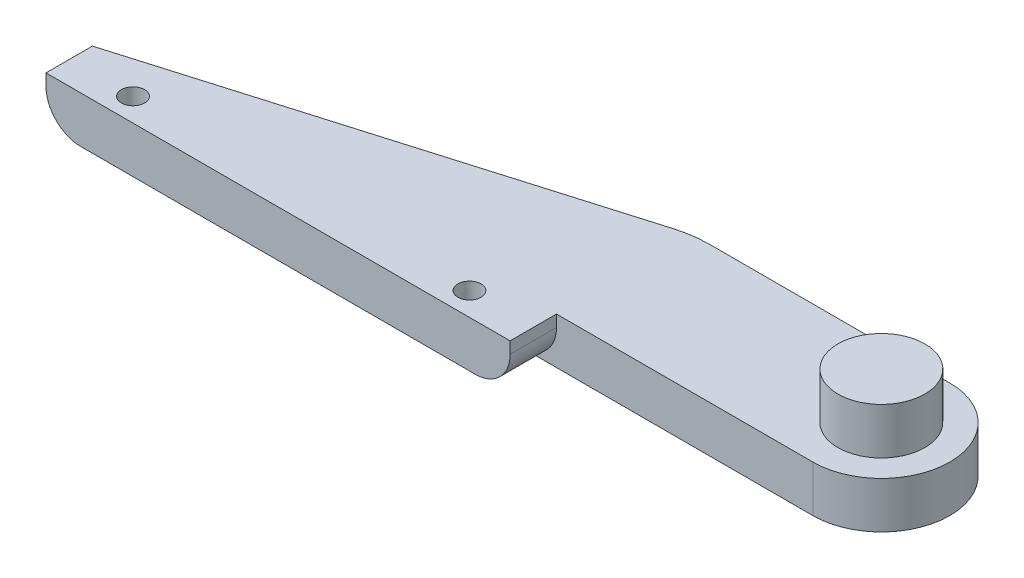
ISO-10303-21;
HEADER;
FILE_DESCRIPTION(('STEP AP214'),'2;1');
FILE_NAME('part.step','',(''),(''),'','','');
FILE_SCHEMA(('AUTOMOTIVE_DESIGN { 1 0 10303 214 1 1 1 1 }'));
ENDSEC;
DATA;
#1=APPLICATION_CONTEXT('core data for automotive mechanical design processes');
#2=APPLICATION_PROTOCOL_DEFINITION('international standard','automotive_design',2000,#1);
#3=PRODUCT_CONTEXT('',#1,'mechanical');
#4=PRODUCT('Part','Part','',(#3));
#5=PRODUCT_RELATED_PRODUCT_CATEGORY('part','',(#4));
#6=PRODUCT_DEFINITION_FORMATION('','',#4);
#7=PRODUCT_DEFINITION_CONTEXT('part definition',#1,'design');
#8=PRODUCT_DEFINITION('design','',#6,#7);
#9=PRODUCT_DEFINITION_SHAPE('','',#8);
#10=(LENGTH_UNIT() NAMED_UNIT(*) SI_UNIT(.MILLI.,.METRE.));
#11=(NAMED_UNIT(*) PLANE_ANGLE_UNIT() SI_UNIT($,.RADIAN.));
#12=(NAMED_UNIT(*) SI_UNIT($,.STERADIAN.) SOLID_ANGLE_UNIT());
#13=UNCERTAINTY_MEASURE_WITH_UNIT(LENGTH_MEASURE(1.E-05),#10,'distance_accuracy_value','');
#14=(GEOMETRIC_REPRESENTATION_CONTEXT(3) GLOBAL_UNCERTAINTY_ASSIGNED_CONTEXT((#13)) GLOBAL_UNIT_ASSIGNED_CONTEXT((#10,
#11,#12)) REPRESENTATION_CONTEXT('',''));
#15=CARTESIAN_POINT('',(0.,0.,0.));
#16=DIRECTION('',(0.,0.,1.));
#17=DIRECTION('',(1.,0.,0.));
#18=AXIS2_PLACEMENT_3D('',#15,#16,#17);
#19=CARTESIAN_POINT('',(20.,4.,-2.));
#20=DIRECTION('',(0.,0.,-1.));
#21=DIRECTION('',(-1.,0.,0.));
#22=AXIS2_PLACEMENT_3D('',#19,#20,#21);
#23=PLANE('',#22);
#24=DIRECTION('',(1.,0.,0.));
#25=VECTOR('',#24,1.);
#26=CARTESIAN_POINT('',(20.,0.,-2.));
#27=LINE('',#26,#25);
#28=CARTESIAN_POINT('',(17.,0.,-2.));
#29=VERTEX_POINT('',#28);
#30=CARTESIAN_POINT('',(42.1,0.,-2.));
#31=VERTEX_POINT('',#30);
#32=EDGE_CURVE('E53',#29,#31,#27,.T.);
#33=ORIENTED_EDGE('',*,*,#32,.T.);
#34=DIRECTION('',(0.,-1.,0.));
#35=VECTOR('',#34,1.);
#36=CARTESIAN_POINT('',(42.1,4.,-2.));
#37=LINE('',#36,#35);
#38=CARTESIAN_POINT('',(42.1,4.,-2.));
#39=VERTEX_POINT('',#38);
#40=EDGE_CURVE('E112',#39,#31,#37,.T.);
#41=ORIENTED_EDGE('',*,*,#40,.F.);
#42=DIRECTION('',(1.,0.,0.));
#43=VECTOR('',#42,1.);
#44=CARTESIAN_POINT('',(20.,4.,-2.));
#45=LINE('',#44,#43);
#46=CARTESIAN_POINT('',(20.,4.,-2.));
#47=VERTEX_POINT('',#46);
#48=EDGE_CURVE('E119',#47,#39,#45,.T.);
#49=ORIENTED_EDGE('',*,*,#48,.F.);
#50=DIRECTION('',(0.,-1.,0.));
#51=VECTOR('',#50,1.);
#52=CARTESIAN_POINT('',(20.,4.,-2.));
#53=LINE('',#52,#51);
#54=CARTESIAN_POINT('',(20.,3.,-2.));
#55=VERTEX_POINT('',#54);
#56=EDGE_CURVE('E159',#47,#55,#53,.T.);
#57=ORIENTED_EDGE('',*,*,#56,.T.);
#58=CARTESIAN_POINT('',(17.,3.,-2.));
#59=DIRECTION('',(0.,0.,-1.));
#60=DIRECTION('',(-1.,0.,0.));
#61=AXIS2_PLACEMENT_3D('',#58,#59,#60);
#62=CIRCLE('',#61,3.);
#63=EDGE_CURVE('E11',#55,#29,#62,.T.);
#64=ORIENTED_EDGE('',*,*,#63,.T.);
#65=EDGE_LOOP('',(#33,#41,#49,#57,#64));
#66=FACE_BOUND('',#65,.T.);
#67=ADVANCED_FACE('F32',(#66),#23,.F.);
#68=CARTESIAN_POINT('',(42.1,4.,-7.9));
#69=DIRECTION('',(0.,-1.,0.));
#70=DIRECTION('',(0.,0.,-1.));
#71=AXIS2_PLACEMENT_3D('',#68,#69,#70);
#72=CYLINDRICAL_SURFACE('',#71,5.9);
#73=CARTESIAN_POINT('',(42.1,0.,-7.9));
#74=DIRECTION('',(0.,1.,0.));
#75=DIRECTION('',(0.,0.,-1.));
#76=AXIS2_PLACEMENT_3D('',#73,#74,#75);
#77=CIRCLE('',#76,5.9);
#78=CARTESIAN_POINT('',(42.1,0.,-13.8));
#79=VERTEX_POINT('',#78);
#80=EDGE_CURVE('E197',#31,#79,#77,.T.);
#81=ORIENTED_EDGE('',*,*,#80,.T.);
#82=DIRECTION('',(0.,-1.,0.));
#83=VECTOR('',#82,1.);
#84=CARTESIAN_POINT('',(42.1,4.,-13.8));
#85=LINE('',#84,#83);
#86=CARTESIAN_POINT('',(42.1,4.,-13.8));
#87=VERTEX_POINT('',#86);
#88=EDGE_CURVE('E114',#87,#79,#85,.T.);
#89=ORIENTED_EDGE('',*,*,#88,.F.);
#90=CARTESIAN_POINT('',(42.1,4.,-7.9));
#91=DIRECTION('',(0.,1.,0.));
#92=DIRECTION('',(0.,0.,-1.));
#93=AXIS2_PLACEMENT_3D('',#90,#91,#92);
#94=CIRCLE('',#93,5.9);
#95=EDGE_CURVE('E108',#39,#87,#94,.T.);
#96=ORIENTED_EDGE('',*,*,#95,.F.);
#97=ORIENTED_EDGE('',*,*,#40,.T.);
#98=EDGE_LOOP('',(#81,#89,#96,#97));
#99=FACE_BOUND('',#98,.T.);
#100=ADVANCED_FACE('F110',(#99),#72,.T.);
#101=CARTESIAN_POINT('',(20.,4.,-13.8));
#102=DIRECTION('',(0.,0.,1.));
#103=DIRECTION('',(1.,0.,0.));
#104=AXIS2_PLACEMENT_3D('',#101,#102,#103);
#105=PLANE('',#104);
#106=DIRECTION('',(-1.,0.,0.));
#107=VECTOR('',#106,1.);
#108=CARTESIAN_POINT('',(20.,0.,-13.8));
#109=LINE('',#108,#107);
#110=CARTESIAN_POINT('',(21.4442342640121,0.,-13.8));
#111=VERTEX_POINT('',#110);
#112=EDGE_CURVE('E195',#79,#111,#109,.T.);
#113=ORIENTED_EDGE('',*,*,#112,.T.);
#114=DIRECTION('',(0.,-1.,0.));
#115=VECTOR('',#114,1.);
#116=CARTESIAN_POINT('',(21.4442342640121,4.,-13.8));
#117=LINE('',#116,#115);
#118=CARTESIAN_POINT('',(21.4442342640121,4.,-13.8));
#119=VERTEX_POINT('',#118);
#120=EDGE_CURVE('E140',#111,#119,#117,.F.);
#121=ORIENTED_EDGE('',*,*,#120,.T.);
#122=DIRECTION('',(-1.,0.,0.));
#123=VECTOR('',#122,1.);
#124=CARTESIAN_POINT('',(20.,4.,-13.8));
#125=LINE('',#124,#123);
#126=EDGE_CURVE('E118',#87,#119,#125,.T.);
#127=ORIENTED_EDGE('',*,*,#126,.F.);
#128=ORIENTED_EDGE('',*,*,#88,.T.);
#129=EDGE_LOOP('',(#113,#121,#127,#128));
#130=FACE_BOUND('',#129,.T.);
#131=ADVANCED_FACE('F261',(#130),#105,.F.);
#132=CARTESIAN_POINT('',(-20.,4.,-2.));
#133=DIRECTION('',(0.282945147243684,0.,0.959136092351471));
#134=DIRECTION('',(0.959136092351471,0.,-0.282945147243684));
#135=AXIS2_PLACEMENT_3D('',#132,#133,#134);
#136=PLANE('',#135);
#137=DIRECTION('',(-0.959136092351471,0.,0.282945147243684));
#138=VECTOR('',#137,1.);
#139=CARTESIAN_POINT('',(-20.,0.,-2.));
#140=LINE('',#139,#138);
#141=CARTESIAN_POINT('',(18.6147827915753,0.,-13.3913609235147));
#142=VERTEX_POINT('',#141);
#143=CARTESIAN_POINT('',(-17.,0.,-2.885));
#144=VERTEX_POINT('',#143);
#145=EDGE_CURVE('E194',#142,#144,#140,.T.);
#146=ORIENTED_EDGE('',*,*,#145,.T.);
#147=CARTESIAN_POINT('',(-17.,3.,-2.885));
#148=DIRECTION('',(0.282945147243684,0.,0.959136092351471));
#149=DIRECTION('',(0.959136092351471,0.,-0.282945147243684));
#150=AXIS2_PLACEMENT_3D('',#147,#148,#149);
#151=ELLIPSE('',#150,3.12781473236507,3.);
#152=CARTESIAN_POINT('',(-20.,3.,-2.));
#153=VERTEX_POINT('',#152);
#154=EDGE_CURVE('E155',#144,#153,#151,.F.);
#155=ORIENTED_EDGE('',*,*,#154,.T.);
#156=DIRECTION('',(0.,-1.,0.));
#157=VECTOR('',#156,1.);
#158=CARTESIAN_POINT('',(-20.,4.,-2.));
#159=LINE('',#158,#157);
#160=CARTESIAN_POINT('',(-20.,4.,-2.));
#161=VERTEX_POINT('',#160);
#162=EDGE_CURVE('E135',#161,#153,#159,.T.);
#163=ORIENTED_EDGE('',*,*,#162,.F.);
#164=DIRECTION('',(-0.959136092351471,0.,0.282945147243684));
#165=VECTOR('',#164,1.);
#166=CARTESIAN_POINT('',(-20.,4.,-2.));
#167=LINE('',#166,#165);
#168=CARTESIAN_POINT('',(18.6147827915753,4.,-13.3913609235147));
#169=VERTEX_POINT('',#168);
#170=EDGE_CURVE('E205',#169,#161,#167,.T.);
#171=ORIENTED_EDGE('',*,*,#170,.F.);
#172=DIRECTION('',(0.,-1.,0.));
#173=VECTOR('',#172,1.);
#174=CARTESIAN_POINT('',(18.6147827915753,4.,-13.3913609235147));
#175=LINE('',#174,#173);
#176=EDGE_CURVE('E130',#169,#142,#175,.T.);
#177=ORIENTED_EDGE('',*,*,#176,.T.);
#178=EDGE_LOOP('',(#146,#155,#163,#171,#177));
#179=FACE_BOUND('',#178,.T.);
#180=ADVANCED_FACE('F276',(#179),#136,.F.);
#181=CARTESIAN_POINT('',(-20.,4.,2.));
#182=DIRECTION('',(1.,0.,0.));
#183=DIRECTION('',(0.,0.,-1.));
#184=AXIS2_PLACEMENT_3D('',#181,#182,#183);
#185=PLANE('',#184);
#186=ORIENTED_EDGE('',*,*,#162,.T.);
#187=DIRECTION('',(0.,0.,1.));
#188=VECTOR('',#187,1.);
#189=CARTESIAN_POINT('',(-20.,3.,2.));
#190=LINE('',#189,#188);
#191=CARTESIAN_POINT('',(-20.,3.,2.));
#192=VERTEX_POINT('',#191);
#193=EDGE_CURVE('E144',#153,#192,#190,.T.);
#194=ORIENTED_EDGE('',*,*,#193,.T.);
#195=DIRECTION('',(0.,-1.,0.));
#196=VECTOR('',#195,1.);
#197=CARTESIAN_POINT('',(-20.,4.,2.));
#198=LINE('',#197,#196);
#199=CARTESIAN_POINT('',(-20.,4.,2.));
#200=VERTEX_POINT('',#199);
#201=EDGE_CURVE('E164',#200,#192,#198,.T.);
#202=ORIENTED_EDGE('',*,*,#201,.F.);
#203=DIRECTION('',(0.,0.,1.));
#204=VECTOR('',#203,1.);
#205=CARTESIAN_POINT('',(-20.,4.,2.));
#206=LINE('',#205,#204);
#207=EDGE_CURVE('E179',#161,#200,#206,.T.);
#208=ORIENTED_EDGE('',*,*,#207,.F.);
#209=EDGE_LOOP('',(#186,#194,#202,#208));
#210=FACE_BOUND('',#209,.T.);
#211=ADVANCED_FACE('F177',(#210),#185,.F.);
#212=CARTESIAN_POINT('',(-20.,4.,2.));
#213=DIRECTION('',(0.,0.,-1.));
#214=DIRECTION('',(-1.,0.,0.));
#215=AXIS2_PLACEMENT_3D('',#212,#213,#214);
#216=PLANE('',#215);
#217=ORIENTED_EDGE('',*,*,#201,.T.);
#218=CARTESIAN_POINT('',(-17.,3.,2.));
#219=DIRECTION('',(0.,0.,-1.));
#220=DIRECTION('',(-1.,0.,0.));
#221=AXIS2_PLACEMENT_3D('',#218,#219,#220);
#222=CIRCLE('',#221,3.);
#223=CARTESIAN_POINT('',(-17.,0.,2.));
#224=VERTEX_POINT('',#223);
#225=EDGE_CURVE('E149',#192,#224,#222,.F.);
#226=ORIENTED_EDGE('',*,*,#225,.T.);
#227=DIRECTION('',(1.,0.,0.));
#228=VECTOR('',#227,1.);
#229=CARTESIAN_POINT('',(-20.,0.,2.));
#230=LINE('',#229,#228);
#231=CARTESIAN_POINT('',(17.,0.,2.));
#232=VERTEX_POINT('',#231);
#233=EDGE_CURVE('E128',#224,#232,#230,.T.);
#234=ORIENTED_EDGE('',*,*,#233,.T.);
#235=CARTESIAN_POINT('',(17.,3.,2.));
#236=DIRECTION('',(0.,0.,-1.));
#237=DIRECTION('',(-1.,0.,0.));
#238=AXIS2_PLACEMENT_3D('',#235,#236,#237);
#239=CIRCLE('',#238,3.);
#240=CARTESIAN_POINT('',(20.,3.,2.));
#241=VERTEX_POINT('',#240);
#242=EDGE_CURVE('E147',#232,#241,#239,.F.);
#243=ORIENTED_EDGE('',*,*,#242,.T.);
#244=DIRECTION('',(0.,-1.,0.));
#245=VECTOR('',#244,1.);
#246=CARTESIAN_POINT('',(20.,4.,2.));
#247=LINE('',#246,#245);
#248=CARTESIAN_POINT('',(20.,4.,2.));
#249=VERTEX_POINT('',#248);
#250=EDGE_CURVE('E161',#249,#241,#247,.T.);
#251=ORIENTED_EDGE('',*,*,#250,.F.);
#252=DIRECTION('',(1.,0.,0.));
#253=VECTOR('',#252,1.);
#254=CARTESIAN_POINT('',(-20.,4.,2.));
#255=LINE('',#254,#253);
#256=EDGE_CURVE('E166',#200,#249,#255,.T.);
#257=ORIENTED_EDGE('',*,*,#256,.F.);
#258=EDGE_LOOP('',(#217,#226,#234,#243,#251,#257));
#259=FACE_BOUND('',#258,.T.);
#260=ADVANCED_FACE('F189',(#259),#216,.F.);
#261=CARTESIAN_POINT('',(20.,4.,2.));
#262=DIRECTION('',(-1.,0.,0.));
#263=DIRECTION('',(0.,0.,1.));
#264=AXIS2_PLACEMENT_3D('',#261,#262,#263);
#265=PLANE('',#264);
#266=ORIENTED_EDGE('',*,*,#250,.T.);
#267=DIRECTION('',(0.,0.,-1.));
#268=VECTOR('',#267,1.);
#269=CARTESIAN_POINT('',(20.,3.,-2.));
#270=LINE('',#269,#268);
#271=EDGE_CURVE('E40',#241,#55,#270,.T.);
#272=ORIENTED_EDGE('',*,*,#271,.T.);
#273=ORIENTED_EDGE('',*,*,#56,.F.);
#274=DIRECTION('',(0.,0.,-1.));
#275=VECTOR('',#274,1.);
#276=CARTESIAN_POINT('',(20.,4.,2.));
#277=LINE('',#276,#275);
#278=EDGE_CURVE('E124',#249,#47,#277,.T.);
#279=ORIENTED_EDGE('',*,*,#278,.F.);
#280=EDGE_LOOP('',(#266,#272,#273,#279));
#281=FACE_BOUND('',#280,.T.);
#282=ADVANCED_FACE('F158',(#281),#265,.F.);
#283=CARTESIAN_POINT('',(42.1,4.,-7.9));
#284=DIRECTION('',(0.,-1.,0.));
#285=DIRECTION('',(0.,0.,-1.));
#286=AXIS2_PLACEMENT_3D('',#283,#284,#285);
#287=PLANE('',#286);
#288=CARTESIAN_POINT('',(14.5,4.,0.));
#289=DIRECTION('',(0.,-1.,0.));
#290=DIRECTION('',(0.,0.,-1.));
#291=AXIS2_PLACEMENT_3D('',#288,#289,#290);
#292=CIRCLE('',#291,1.);
#293=CARTESIAN_POINT('',(14.5,4.,-1.));
#294=VERTEX_POINT('',#293);
#295=EDGE_CURVE('E219',#294,#294,#292,.T.);
#296=ORIENTED_EDGE('',*,*,#295,.T.);
#297=EDGE_LOOP('',(#296));
#298=FACE_BOUND('',#297,.T.);
#299=CARTESIAN_POINT('',(-14.5,4.,0.));
#300=DIRECTION('',(0.,-1.,0.));
#301=DIRECTION('',(0.,0.,-1.));
#302=AXIS2_PLACEMENT_3D('',#299,#300,#301);
#303=CIRCLE('',#302,1.);
#304=CARTESIAN_POINT('',(-14.5,4.,-1.));
#305=VERTEX_POINT('',#304);
#306=EDGE_CURVE('E211',#305,#305,#303,.T.);
#307=ORIENTED_EDGE('',*,*,#306,.T.);
#308=EDGE_LOOP('',(#307));
#309=FACE_BOUND('',#308,.T.);
#310=CARTESIAN_POINT('',(42.1,4.,-7.9));
#311=DIRECTION('',(0.,-1.,0.));
#312=DIRECTION('',(0.,0.,-1.));
#313=AXIS2_PLACEMENT_3D('',#310,#311,#312);
#314=CIRCLE('',#313,3.74618150465741);
#315=CARTESIAN_POINT('',(42.1,4.,-11.6461815046574));
#316=VERTEX_POINT('',#315);
#317=EDGE_CURVE('E208',#316,#316,#314,.T.);
#318=ORIENTED_EDGE('',*,*,#317,.T.);
#319=EDGE_LOOP('',(#318));
#320=FACE_BOUND('',#319,.T.);
#321=ORIENTED_EDGE('',*,*,#126,.T.);
#322=CARTESIAN_POINT('',(21.4442342640121,4.,-3.8));
#323=DIRECTION('',(0.,-1.,0.));
#324=DIRECTION('',(0.,0.,-1.));
#325=AXIS2_PLACEMENT_3D('',#322,#323,#324);
#326=CIRCLE('',#325,10.);
#327=EDGE_CURVE('E142',#119,#169,#326,.F.);
#328=ORIENTED_EDGE('',*,*,#327,.T.);
#329=ORIENTED_EDGE('',*,*,#170,.T.);
#330=ORIENTED_EDGE('',*,*,#207,.T.);
#331=ORIENTED_EDGE('',*,*,#256,.T.);
#332=ORIENTED_EDGE('',*,*,#278,.T.);
#333=ORIENTED_EDGE('',*,*,#48,.T.);
#334=ORIENTED_EDGE('',*,*,#95,.T.);
#335=EDGE_LOOP('',(#321,#328,#329,#330,#331,#332,#333,#334));
#336=FACE_BOUND('',#335,.T.);
#337=ADVANCED_FACE('F122',(#298,#309,#320,#336),#287,.F.);
#338=CARTESIAN_POINT('',(42.1,0.,-7.9));
#339=DIRECTION('',(0.,-1.,0.));
#340=DIRECTION('',(0.,0.,-1.));
#341=AXIS2_PLACEMENT_3D('',#338,#339,#340);
#342=PLANE('',#341);
#343=CARTESIAN_POINT('',(14.5,0.,0.));
#344=DIRECTION('',(0.,-1.,0.));
#345=DIRECTION('',(0.,0.,-1.));
#346=AXIS2_PLACEMENT_3D('',#343,#344,#345);
#347=CIRCLE('',#346,1.);
#348=CARTESIAN_POINT('',(14.5,0.,-1.));
#349=VERTEX_POINT('',#348);
#350=EDGE_CURVE('E222',#349,#349,#347,.T.);
#351=ORIENTED_EDGE('',*,*,#350,.F.);
#352=EDGE_LOOP('',(#351));
#353=FACE_BOUND('',#352,.T.);
#354=CARTESIAN_POINT('',(-14.5,0.,0.));
#355=DIRECTION('',(0.,-1.,0.));
#356=DIRECTION('',(0.,0.,-1.));
#357=AXIS2_PLACEMENT_3D('',#354,#355,#356);
#358=CIRCLE('',#357,1.);
#359=CARTESIAN_POINT('',(-14.5,0.,-1.));
#360=VERTEX_POINT('',#359);
#361=EDGE_CURVE('E216',#360,#360,#358,.T.);
#362=ORIENTED_EDGE('',*,*,#361,.F.);
#363=EDGE_LOOP('',(#362));
#364=FACE_BOUND('',#363,.T.);
#365=ORIENTED_EDGE('',*,*,#233,.F.);
#366=DIRECTION('',(0.,0.,1.));
#367=VECTOR('',#366,1.);
#368=CARTESIAN_POINT('',(-17.,0.,-2.));
#369=LINE('',#368,#367);
#370=EDGE_CURVE('E153',#224,#144,#369,.F.);
#371=ORIENTED_EDGE('',*,*,#370,.T.);
#372=ORIENTED_EDGE('',*,*,#145,.F.);
#373=CARTESIAN_POINT('',(21.4442342640121,0.,-3.8));
#374=DIRECTION('',(0.,-1.,0.));
#375=DIRECTION('',(0.,0.,-1.));
#376=AXIS2_PLACEMENT_3D('',#373,#374,#375);
#377=CIRCLE('',#376,10.);
#378=EDGE_CURVE('E133',#142,#111,#377,.T.);
#379=ORIENTED_EDGE('',*,*,#378,.T.);
#380=ORIENTED_EDGE('',*,*,#112,.F.);
#381=ORIENTED_EDGE('',*,*,#80,.F.);
#382=ORIENTED_EDGE('',*,*,#32,.F.);
#383=DIRECTION('',(0.,0.,-1.));
#384=VECTOR('',#383,1.);
#385=CARTESIAN_POINT('',(17.,0.,2.));
#386=LINE('',#385,#384);
#387=EDGE_CURVE('E151',#29,#232,#386,.F.);
#388=ORIENTED_EDGE('',*,*,#387,.T.);
#389=EDGE_LOOP('',(#365,#371,#372,#379,#380,#381,#382,#388));
#390=FACE_BOUND('',#389,.T.);
#391=ADVANCED_FACE('F191',(#353,#364,#390),#342,.T.);
#392=CARTESIAN_POINT('',(42.1,8.,-7.9));
#393=DIRECTION('',(0.,-1.,0.));
#394=DIRECTION('',(0.,0.,-1.));
#395=AXIS2_PLACEMENT_3D('',#392,#393,#394);
#396=CYLINDRICAL_SURFACE('',#395,3.74618150465741);
#397=CARTESIAN_POINT('',(42.1,8.,-7.9));
#398=DIRECTION('',(0.,-1.,0.));
#399=DIRECTION('',(0.,0.,-1.));
#400=AXIS2_PLACEMENT_3D('',#397,#398,#399);
#401=CIRCLE('',#400,3.74618150465741);
#402=CARTESIAN_POINT('',(42.1,8.,-11.6461815046574));
#403=VERTEX_POINT('',#402);
#404=EDGE_CURVE('E201',#403,#403,#401,.T.);
#405=ORIENTED_EDGE('',*,*,#404,.T.);
#406=EDGE_LOOP('',(#405));
#407=FACE_BOUND('',#406,.T.);
#408=ORIENTED_EDGE('',*,*,#317,.F.);
#409=EDGE_LOOP('',(#408));
#410=FACE_BOUND('',#409,.T.);
#411=ADVANCED_FACE('F231',(#407,#410),#396,.T.);
#412=CARTESIAN_POINT('',(42.1,8.,-7.9));
#413=DIRECTION('',(0.,-1.,0.));
#414=DIRECTION('',(0.,0.,-1.));
#415=AXIS2_PLACEMENT_3D('',#412,#413,#414);
#416=PLANE('',#415);
#417=ORIENTED_EDGE('',*,*,#404,.F.);
#418=EDGE_LOOP('',(#417));
#419=FACE_BOUND('',#418,.T.);
#420=ADVANCED_FACE('F238',(#419),#416,.F.);
#421=CARTESIAN_POINT('',(-14.5,8.,0.));
#422=DIRECTION('',(0.,-1.,0.));
#423=DIRECTION('',(0.,0.,-1.));
#424=AXIS2_PLACEMENT_3D('',#421,#422,#423);
#425=CYLINDRICAL_SURFACE('',#424,1.);
#426=ORIENTED_EDGE('',*,*,#361,.T.);
#427=EDGE_LOOP('',(#426));
#428=FACE_BOUND('',#427,.T.);
#429=ORIENTED_EDGE('',*,*,#306,.F.);
#430=EDGE_LOOP('',(#429));
#431=FACE_BOUND('',#430,.T.);
#432=ADVANCED_FACE('F235',(#428,#431),#425,.F.);
#433=CARTESIAN_POINT('',(14.5,8.,0.));
#434=DIRECTION('',(0.,-1.,0.));
#435=DIRECTION('',(0.,0.,-1.));
#436=AXIS2_PLACEMENT_3D('',#433,#434,#435);
#437=CYLINDRICAL_SURFACE('',#436,1.);
#438=ORIENTED_EDGE('',*,*,#350,.T.);
#439=EDGE_LOOP('',(#438));
#440=FACE_BOUND('',#439,.T.);
#441=ORIENTED_EDGE('',*,*,#295,.F.);
#442=EDGE_LOOP('',(#441));
#443=FACE_BOUND('',#442,.T.);
#444=ADVANCED_FACE('F226',(#440,#443),#437,.F.);
#445=CARTESIAN_POINT('',(21.4442342640121,4.,-3.8));
#446=DIRECTION('',(0.,-1.,0.));
#447=DIRECTION('',(0.,0.,-1.));
#448=AXIS2_PLACEMENT_3D('',#445,#446,#447);
#449=CYLINDRICAL_SURFACE('',#448,10.);
#450=ORIENTED_EDGE('',*,*,#327,.F.);
#451=ORIENTED_EDGE('',*,*,#120,.F.);
#452=ORIENTED_EDGE('',*,*,#378,.F.);
#453=ORIENTED_EDGE('',*,*,#176,.F.);
#454=EDGE_LOOP('',(#450,#451,#452,#453));
#455=FACE_BOUND('',#454,.T.);
#456=ADVANCED_FACE('F265',(#455),#449,.T.);
#457=CARTESIAN_POINT('',(-17.,3.,2.));
#458=DIRECTION('',(0.,0.,-1.));
#459=DIRECTION('',(-1.,0.,0.));
#460=AXIS2_PLACEMENT_3D('',#457,#458,#459);
#461=CYLINDRICAL_SURFACE('',#460,3.);
#462=ORIENTED_EDGE('',*,*,#154,.F.);
#463=ORIENTED_EDGE('',*,*,#370,.F.);
#464=ORIENTED_EDGE('',*,*,#225,.F.);
#465=ORIENTED_EDGE('',*,*,#193,.F.);
#466=EDGE_LOOP('',(#462,#463,#464,#465));
#467=FACE_BOUND('',#466,.T.);
#468=ADVANCED_FACE('F184',(#467),#461,.T.);
#469=CARTESIAN_POINT('',(17.,3.,2.));
#470=DIRECTION('',(0.,0.,1.));
#471=DIRECTION('',(1.,0.,0.));
#472=AXIS2_PLACEMENT_3D('',#469,#470,#471);
#473=CYLINDRICAL_SURFACE('',#472,3.);
#474=ORIENTED_EDGE('',*,*,#242,.F.);
#475=ORIENTED_EDGE('',*,*,#387,.F.);
#476=ORIENTED_EDGE('',*,*,#63,.F.);
#477=ORIENTED_EDGE('',*,*,#271,.F.);
#478=EDGE_LOOP('',(#474,#475,#476,#477));
#479=FACE_BOUND('',#478,.T.);
#480=ADVANCED_FACE('F34',(#479),#473,.T.);
#481=CLOSED_SHELL('',(#67,#100,#131,#180,#211,#260,#282,#337,#391,#411,#420,#432,#444,#456,#468,#480));
#482=MANIFOLD_SOLID_BREP('B2',#481);
#483=ADVANCED_BREP_SHAPE_REPRESENTATION('',(#18,#482),#14);
#484=SHAPE_DEFINITION_REPRESENTATION(#9,#483);
ENDSEC;
END-ISO-10303-21;
